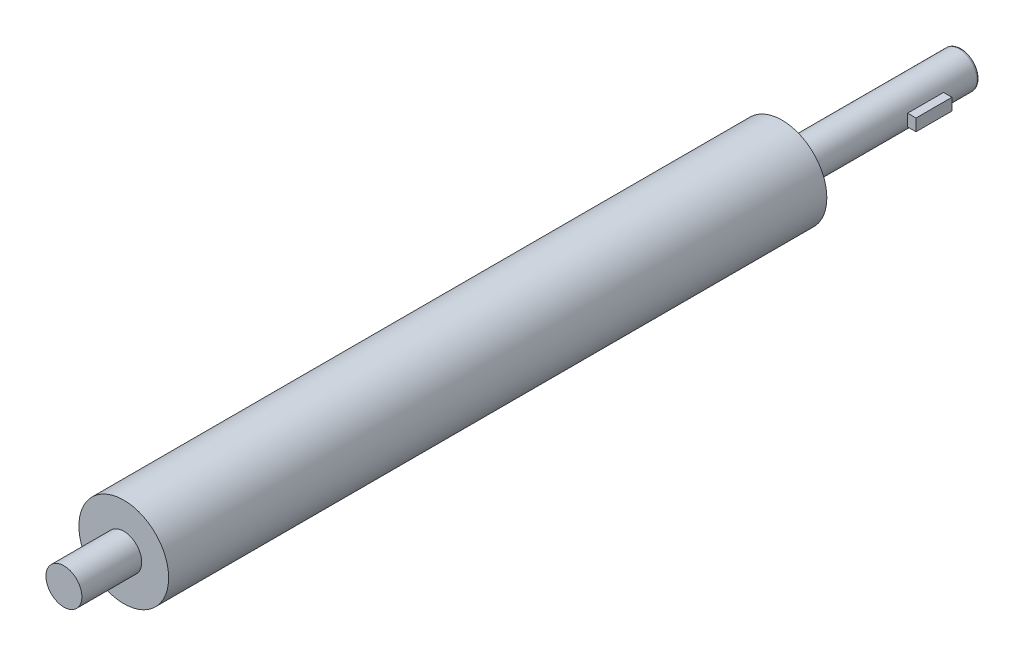
ISO-10303-21;
HEADER;
FILE_DESCRIPTION(('STEP AP214'),'2;1');
FILE_NAME('part.step','',(''),(''),'','','');
FILE_SCHEMA(('AUTOMOTIVE_DESIGN { 1 0 10303 214 1 1 1 1 }'));
ENDSEC;
DATA;
#1=APPLICATION_CONTEXT('core data for automotive mechanical design processes');
#2=APPLICATION_PROTOCOL_DEFINITION('international standard','automotive_design',2000,#1);
#3=PRODUCT_CONTEXT('',#1,'mechanical');
#4=PRODUCT('Part','Part','',(#3));
#5=PRODUCT_RELATED_PRODUCT_CATEGORY('part','',(#4));
#6=PRODUCT_DEFINITION_FORMATION('','',#4);
#7=PRODUCT_DEFINITION_CONTEXT('part definition',#1,'design');
#8=PRODUCT_DEFINITION('design','',#6,#7);
#9=PRODUCT_DEFINITION_SHAPE('','',#8);
#10=(LENGTH_UNIT() NAMED_UNIT(*) SI_UNIT(.MILLI.,.METRE.));
#11=(NAMED_UNIT(*) PLANE_ANGLE_UNIT() SI_UNIT($,.RADIAN.));
#12=(NAMED_UNIT(*) SI_UNIT($,.STERADIAN.) SOLID_ANGLE_UNIT());
#13=UNCERTAINTY_MEASURE_WITH_UNIT(LENGTH_MEASURE(1.E-05),#10,'distance_accuracy_value','');
#14=(GEOMETRIC_REPRESENTATION_CONTEXT(3) GLOBAL_UNCERTAINTY_ASSIGNED_CONTEXT((#13)) GLOBAL_UNIT_ASSIGNED_CONTEXT((#10,
#11,#12)) REPRESENTATION_CONTEXT('',''));
#15=CARTESIAN_POINT('',(0.,0.,0.));
#16=DIRECTION('',(0.,0.,1.));
#17=DIRECTION('',(1.,0.,0.));
#18=AXIS2_PLACEMENT_3D('',#15,#16,#17);
#19=CARTESIAN_POINT('',(22.,5.00000000000001,-120.));
#20=DIRECTION('',(0.,0.,1.));
#21=DIRECTION('',(1.,0.,0.));
#22=AXIS2_PLACEMENT_3D('',#19,#20,#21);
#23=PLANE('',#22);
#24=DIRECTION('',(0.,1.,0.));
#25=VECTOR('',#24,1.);
#26=CARTESIAN_POINT('',(15.,5.00000000000001,-120.));
#27=LINE('',#26,#25);
#28=CARTESIAN_POINT('',(15.,-4.99999999999999,-120.));
#29=VERTEX_POINT('',#28);
#30=CARTESIAN_POINT('',(15.,5.00000000000001,-120.));
#31=VERTEX_POINT('',#30);
#32=EDGE_CURVE('E112',#29,#31,#27,.T.);
#33=ORIENTED_EDGE('',*,*,#32,.T.);
#34=DIRECTION('',(-1.,0.,0.));
#35=VECTOR('',#34,1.);
#36=CARTESIAN_POINT('',(22.,5.00000000000001,-120.));
#37=LINE('',#36,#35);
#38=CARTESIAN_POINT('',(22.,5.00000000000001,-120.));
#39=VERTEX_POINT('',#38);
#40=EDGE_CURVE('E12',#39,#31,#37,.T.);
#41=ORIENTED_EDGE('',*,*,#40,.F.);
#42=DIRECTION('',(0.,1.,0.));
#43=VECTOR('',#42,1.);
#44=CARTESIAN_POINT('',(22.,5.00000000000001,-120.));
#45=LINE('',#44,#43);
#46=CARTESIAN_POINT('',(22.,-4.99999999999999,-120.));
#47=VERTEX_POINT('',#46);
#48=EDGE_CURVE('E100',#47,#39,#45,.T.);
#49=ORIENTED_EDGE('',*,*,#48,.F.);
#50=DIRECTION('',(-1.,0.,0.));
#51=VECTOR('',#50,1.);
#52=CARTESIAN_POINT('',(22.,-4.99999999999999,-120.));
#53=LINE('',#52,#51);
#54=EDGE_CURVE('E108',#47,#29,#53,.T.);
#55=ORIENTED_EDGE('',*,*,#54,.T.);
#56=EDGE_LOOP('',(#33,#41,#49,#55));
#57=FACE_BOUND('',#56,.T.);
#58=ADVANCED_FACE('F49',(#57),#23,.F.);
#59=CARTESIAN_POINT('',(22.,5.,-90.));
#60=DIRECTION('',(0.,-1.,0.));
#61=DIRECTION('',(0.,0.,-1.));
#62=AXIS2_PLACEMENT_3D('',#59,#60,#61);
#63=PLANE('',#62);
#64=DIRECTION('',(0.,0.,1.));
#65=VECTOR('',#64,1.);
#66=CARTESIAN_POINT('',(15.,5.,-90.));
#67=LINE('',#66,#65);
#68=CARTESIAN_POINT('',(15.,5.,-90.));
#69=VERTEX_POINT('',#68);
#70=EDGE_CURVE('E104',#31,#69,#67,.T.);
#71=ORIENTED_EDGE('',*,*,#70,.T.);
#72=DIRECTION('',(-1.,0.,0.));
#73=VECTOR('',#72,1.);
#74=CARTESIAN_POINT('',(22.,5.,-90.));
#75=LINE('',#74,#73);
#76=CARTESIAN_POINT('',(22.,5.,-90.));
#77=VERTEX_POINT('',#76);
#78=EDGE_CURVE('E57',#77,#69,#75,.T.);
#79=ORIENTED_EDGE('',*,*,#78,.F.);
#80=DIRECTION('',(0.,0.,1.));
#81=VECTOR('',#80,1.);
#82=CARTESIAN_POINT('',(22.,5.,-90.));
#83=LINE('',#82,#81);
#84=EDGE_CURVE('E95',#39,#77,#83,.T.);
#85=ORIENTED_EDGE('',*,*,#84,.F.);
#86=ORIENTED_EDGE('',*,*,#40,.T.);
#87=EDGE_LOOP('',(#71,#79,#85,#86));
#88=FACE_BOUND('',#87,.T.);
#89=ADVANCED_FACE('F103',(#88),#63,.F.);
#90=CARTESIAN_POINT('',(22.,5.,-90.));
#91=DIRECTION('',(0.,0.,-1.));
#92=DIRECTION('',(-1.,0.,0.));
#93=AXIS2_PLACEMENT_3D('',#90,#91,#92);
#94=PLANE('',#93);
#95=DIRECTION('',(0.,-1.,0.));
#96=VECTOR('',#95,1.);
#97=CARTESIAN_POINT('',(15.,5.,-90.));
#98=LINE('',#97,#96);
#99=CARTESIAN_POINT('',(15.,-5.,-90.));
#100=VERTEX_POINT('',#99);
#101=EDGE_CURVE('E82',#69,#100,#98,.T.);
#102=ORIENTED_EDGE('',*,*,#101,.T.);
#103=DIRECTION('',(-1.,0.,0.));
#104=VECTOR('',#103,1.);
#105=CARTESIAN_POINT('',(22.,-5.,-90.));
#106=LINE('',#105,#104);
#107=CARTESIAN_POINT('',(22.,-5.,-90.));
#108=VERTEX_POINT('',#107);
#109=EDGE_CURVE('E105',#108,#100,#106,.T.);
#110=ORIENTED_EDGE('',*,*,#109,.F.);
#111=DIRECTION('',(0.,-1.,0.));
#112=VECTOR('',#111,1.);
#113=CARTESIAN_POINT('',(22.,5.,-90.));
#114=LINE('',#113,#112);
#115=EDGE_CURVE('E98',#77,#108,#114,.T.);
#116=ORIENTED_EDGE('',*,*,#115,.F.);
#117=ORIENTED_EDGE('',*,*,#78,.T.);
#118=EDGE_LOOP('',(#102,#110,#116,#117));
#119=FACE_BOUND('',#118,.T.);
#120=ADVANCED_FACE('F106',(#119),#94,.F.);
#121=CARTESIAN_POINT('',(22.,-5.,-90.));
#122=DIRECTION('',(0.,1.,0.));
#123=DIRECTION('',(0.,0.,1.));
#124=AXIS2_PLACEMENT_3D('',#121,#122,#123);
#125=PLANE('',#124);
#126=DIRECTION('',(0.,0.,-1.));
#127=VECTOR('',#126,1.);
#128=CARTESIAN_POINT('',(15.,-5.,-90.));
#129=LINE('',#128,#127);
#130=EDGE_CURVE('E88',#100,#29,#129,.T.);
#131=ORIENTED_EDGE('',*,*,#130,.T.);
#132=ORIENTED_EDGE('',*,*,#54,.F.);
#133=DIRECTION('',(0.,0.,-1.));
#134=VECTOR('',#133,1.);
#135=CARTESIAN_POINT('',(22.,-5.,-90.));
#136=LINE('',#135,#134);
#137=EDGE_CURVE('E65',#108,#47,#136,.T.);
#138=ORIENTED_EDGE('',*,*,#137,.F.);
#139=ORIENTED_EDGE('',*,*,#109,.T.);
#140=EDGE_LOOP('',(#131,#132,#138,#139));
#141=FACE_BOUND('',#140,.T.);
#142=ADVANCED_FACE('F119',(#141),#125,.F.);
#143=CARTESIAN_POINT('',(22.,0.,0.));
#144=DIRECTION('',(1.,0.,0.));
#145=DIRECTION('',(0.,0.,-1.));
#146=AXIS2_PLACEMENT_3D('',#143,#144,#145);
#147=PLANE('',#146);
#148=ORIENTED_EDGE('',*,*,#48,.T.);
#149=ORIENTED_EDGE('',*,*,#84,.T.);
#150=ORIENTED_EDGE('',*,*,#115,.T.);
#151=ORIENTED_EDGE('',*,*,#137,.T.);
#152=EDGE_LOOP('',(#148,#149,#150,#151));
#153=FACE_BOUND('',#152,.T.);
#154=ADVANCED_FACE('F96',(#153),#147,.T.);
#155=CARTESIAN_POINT('',(15.,0.,0.));
#156=DIRECTION('',(1.,0.,0.));
#157=DIRECTION('',(0.,0.,-1.));
#158=AXIS2_PLACEMENT_3D('',#155,#156,#157);
#159=PLANE('',#158);
#160=ORIENTED_EDGE('',*,*,#32,.F.);
#161=ORIENTED_EDGE('',*,*,#130,.F.);
#162=ORIENTED_EDGE('',*,*,#101,.F.);
#163=ORIENTED_EDGE('',*,*,#70,.F.);
#164=EDGE_LOOP('',(#160,#161,#162,#163));
#165=FACE_BOUND('',#164,.T.);
#166=ADVANCED_FACE('F122',(#165),#159,.F.);
#167=CLOSED_SHELL('',(#58,#89,#120,#142,#154,#166));
#168=MANIFOLD_SOLID_BREP('B2',#167);
#169=CARTESIAN_POINT('',(0.,0.,550.));
#170=DIRECTION('',(0.,0.,-1.));
#171=DIRECTION('',(-1.,0.,0.));
#172=AXIS2_PLACEMENT_3D('',#169,#170,#171);
#173=CYLINDRICAL_SURFACE('',#172,37.5);
#174=CARTESIAN_POINT('',(0.,0.,550.));
#175=DIRECTION('',(0.,0.,1.));
#176=DIRECTION('',(1.,0.,0.));
#177=AXIS2_PLACEMENT_3D('',#174,#175,#176);
#178=CIRCLE('',#177,37.5);
#179=CARTESIAN_POINT('',(37.5,0.,550.));
#180=VERTEX_POINT('',#179);
#181=EDGE_CURVE('E198',#180,#180,#178,.T.);
#182=ORIENTED_EDGE('',*,*,#181,.F.);
#183=EDGE_LOOP('',(#182));
#184=FACE_BOUND('',#183,.T.);
#185=CARTESIAN_POINT('',(0.,0.,0.));
#186=DIRECTION('',(0.,0.,1.));
#187=DIRECTION('',(1.,0.,0.));
#188=AXIS2_PLACEMENT_3D('',#185,#186,#187);
#189=CIRCLE('',#188,37.5);
#190=CARTESIAN_POINT('',(37.5,0.,0.));
#191=VERTEX_POINT('',#190);
#192=EDGE_CURVE('E194',#191,#191,#189,.T.);
#193=ORIENTED_EDGE('',*,*,#192,.T.);
#194=EDGE_LOOP('',(#193));
#195=FACE_BOUND('',#194,.T.);
#196=ADVANCED_FACE('F173',(#184,#195),#173,.T.);
#197=CARTESIAN_POINT('',(0.,0.,550.));
#198=DIRECTION('',(0.,0.,1.));
#199=DIRECTION('',(1.,0.,0.));
#200=AXIS2_PLACEMENT_3D('',#197,#198,#199);
#201=PLANE('',#200);
#202=CARTESIAN_POINT('',(0.,0.,550.));
#203=DIRECTION('',(0.,0.,1.));
#204=DIRECTION('',(1.,0.,0.));
#205=AXIS2_PLACEMENT_3D('',#202,#203,#204);
#206=CIRCLE('',#205,15.);
#207=CARTESIAN_POINT('',(15.,0.,550.));
#208=VERTEX_POINT('',#207);
#209=EDGE_CURVE('E191',#208,#208,#206,.T.);
#210=ORIENTED_EDGE('',*,*,#209,.F.);
#211=EDGE_LOOP('',(#210));
#212=FACE_BOUND('',#211,.T.);
#213=ORIENTED_EDGE('',*,*,#181,.T.);
#214=EDGE_LOOP('',(#213));
#215=FACE_BOUND('',#214,.T.);
#216=ADVANCED_FACE('F219',(#212,#215),#201,.T.);
#217=CARTESIAN_POINT('',(0.,0.,0.));
#218=DIRECTION('',(0.,0.,1.));
#219=DIRECTION('',(1.,0.,0.));
#220=AXIS2_PLACEMENT_3D('',#217,#218,#219);
#221=PLANE('',#220);
#222=CARTESIAN_POINT('',(0.,0.,0.));
#223=DIRECTION('',(0.,0.,-1.));
#224=DIRECTION('',(-1.,0.,0.));
#225=AXIS2_PLACEMENT_3D('',#222,#223,#224);
#226=CIRCLE('',#225,15.);
#227=CARTESIAN_POINT('',(-15.,0.,0.));
#228=VERTEX_POINT('',#227);
#229=EDGE_CURVE('E186',#228,#228,#226,.T.);
#230=ORIENTED_EDGE('',*,*,#229,.F.);
#231=EDGE_LOOP('',(#230));
#232=FACE_BOUND('',#231,.T.);
#233=ORIENTED_EDGE('',*,*,#192,.F.);
#234=EDGE_LOOP('',(#233));
#235=FACE_BOUND('',#234,.T.);
#236=ADVANCED_FACE('F215',(#232,#235),#221,.F.);
#237=CARTESIAN_POINT('',(0.,0.,600.));
#238=DIRECTION('',(0.,0.,-1.));
#239=DIRECTION('',(-1.,0.,0.));
#240=AXIS2_PLACEMENT_3D('',#237,#238,#239);
#241=CYLINDRICAL_SURFACE('',#240,15.);
#242=CARTESIAN_POINT('',(0.,0.,600.));
#243=DIRECTION('',(0.,0.,1.));
#244=DIRECTION('',(1.,0.,0.));
#245=AXIS2_PLACEMENT_3D('',#242,#243,#244);
#246=CIRCLE('',#245,15.);
#247=CARTESIAN_POINT('',(15.,0.,600.));
#248=VERTEX_POINT('',#247);
#249=EDGE_CURVE('E199',#248,#248,#246,.T.);
#250=ORIENTED_EDGE('',*,*,#249,.F.);
#251=EDGE_LOOP('',(#250));
#252=FACE_BOUND('',#251,.T.);
#253=ORIENTED_EDGE('',*,*,#209,.T.);
#254=EDGE_LOOP('',(#253));
#255=FACE_BOUND('',#254,.T.);
#256=ADVANCED_FACE('F212',(#252,#255),#241,.T.);
#257=CARTESIAN_POINT('',(0.,0.,600.));
#258=DIRECTION('',(0.,0.,1.));
#259=DIRECTION('',(1.,0.,0.));
#260=AXIS2_PLACEMENT_3D('',#257,#258,#259);
#261=PLANE('',#260);
#262=ORIENTED_EDGE('',*,*,#249,.T.);
#263=EDGE_LOOP('',(#262));
#264=FACE_BOUND('',#263,.T.);
#265=ADVANCED_FACE('F210',(#264),#261,.T.);
#266=CARTESIAN_POINT('',(0.,0.,-150.));
#267=DIRECTION('',(0.,0.,1.));
#268=DIRECTION('',(1.,0.,0.));
#269=AXIS2_PLACEMENT_3D('',#266,#267,#268);
#270=CYLINDRICAL_SURFACE('',#269,15.);
#271=CARTESIAN_POINT('',(0.,0.,-148.));
#272=DIRECTION('',(0.,0.,-1.));
#273=DIRECTION('',(-1.,0.,0.));
#274=AXIS2_PLACEMENT_3D('',#271,#272,#273);
#275=CIRCLE('',#274,15.);
#276=CARTESIAN_POINT('',(-15.,0.,-148.));
#277=VERTEX_POINT('',#276);
#278=EDGE_CURVE('E48',#277,#277,#275,.F.);
#279=ORIENTED_EDGE('',*,*,#278,.T.);
#280=EDGE_LOOP('',(#279));
#281=FACE_BOUND('',#280,.T.);
#282=ORIENTED_EDGE('',*,*,#229,.T.);
#283=EDGE_LOOP('',(#282));
#284=FACE_BOUND('',#283,.T.);
#285=ADVANCED_FACE('F238',(#281,#284),#270,.T.);
#286=CARTESIAN_POINT('',(0.,0.,-150.));
#287=DIRECTION('',(0.,0.,-1.));
#288=DIRECTION('',(-1.,0.,0.));
#289=AXIS2_PLACEMENT_3D('',#286,#287,#288);
#290=PLANE('',#289);
#291=CARTESIAN_POINT('',(0.,0.,-150.));
#292=DIRECTION('',(0.,0.,-1.));
#293=DIRECTION('',(-1.,0.,0.));
#294=AXIS2_PLACEMENT_3D('',#291,#292,#293);
#295=CIRCLE('',#294,13.);
#296=CARTESIAN_POINT('',(-13.,0.,-150.));
#297=VERTEX_POINT('',#296);
#298=EDGE_CURVE('E181',#297,#297,#295,.T.);
#299=ORIENTED_EDGE('',*,*,#298,.T.);
#300=EDGE_LOOP('',(#299));
#301=FACE_BOUND('',#300,.T.);
#302=ADVANCED_FACE('F241',(#301),#290,.T.);
#303=CARTESIAN_POINT('',(0.,0.,-148.));
#304=DIRECTION('',(0.,0.,-1.));
#305=DIRECTION('',(-1.,0.,0.));
#306=AXIS2_PLACEMENT_3D('',#303,#304,#305);
#307=TOROIDAL_SURFACE('',#306,13.,2.);
#308=ORIENTED_EDGE('',*,*,#278,.F.);
#309=EDGE_LOOP('',(#308));
#310=FACE_BOUND('',#309,.T.);
#311=ORIENTED_EDGE('',*,*,#298,.F.);
#312=EDGE_LOOP('',(#311));
#313=FACE_BOUND('',#312,.T.);
#314=ADVANCED_FACE('F175',(#310,#313),#307,.T.);
#315=CLOSED_SHELL('',(#196,#216,#236,#256,#265,#285,#302,#314));
#316=MANIFOLD_SOLID_BREP('B6',#315);
#317=ADVANCED_BREP_SHAPE_REPRESENTATION('',(#18,#168,#316),#14);
#318=SHAPE_DEFINITION_REPRESENTATION(#9,#317);
ENDSEC;
END-ISO-10303-21;
